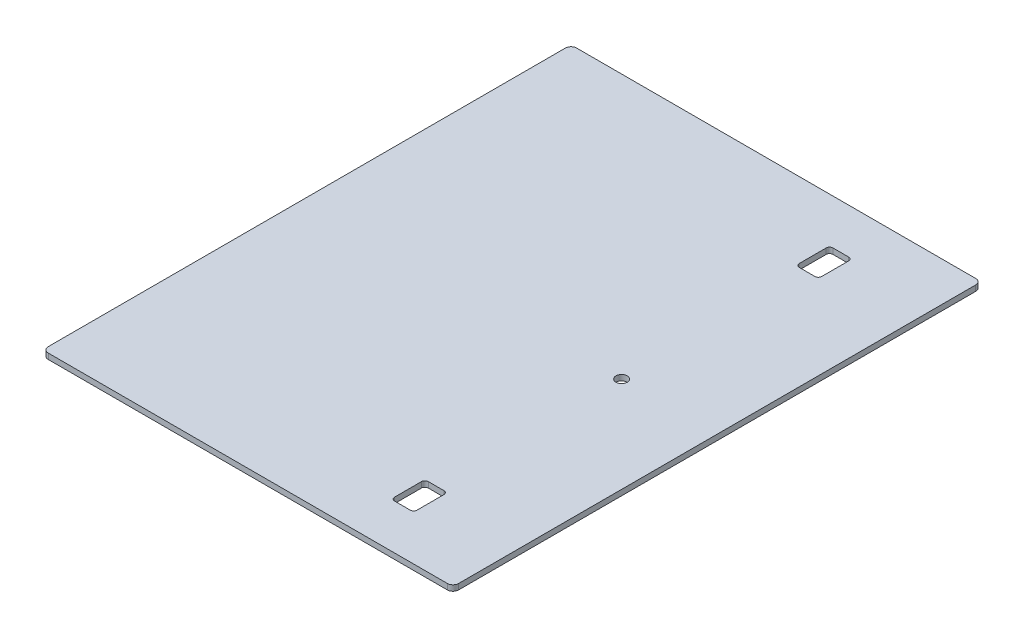
ISO-10303-21;
HEADER;
FILE_DESCRIPTION(('STEP AP214'),'2;1');
FILE_NAME('part.step','',(''),(''),'','','');
FILE_SCHEMA(('AUTOMOTIVE_DESIGN { 1 0 10303 214 1 1 1 1 }'));
ENDSEC;
DATA;
#1=APPLICATION_CONTEXT('core data for automotive mechanical design processes');
#2=APPLICATION_PROTOCOL_DEFINITION('international standard','automotive_design',2000,#1);
#3=PRODUCT_CONTEXT('',#1,'mechanical');
#4=PRODUCT('Part','Part','',(#3));
#5=PRODUCT_RELATED_PRODUCT_CATEGORY('part','',(#4));
#6=PRODUCT_DEFINITION_FORMATION('','',#4);
#7=PRODUCT_DEFINITION_CONTEXT('part definition',#1,'design');
#8=PRODUCT_DEFINITION('design','',#6,#7);
#9=PRODUCT_DEFINITION_SHAPE('','',#8);
#10=(LENGTH_UNIT() NAMED_UNIT(*) SI_UNIT(.MILLI.,.METRE.));
#11=(NAMED_UNIT(*) PLANE_ANGLE_UNIT() SI_UNIT($,.RADIAN.));
#12=(NAMED_UNIT(*) SI_UNIT($,.STERADIAN.) SOLID_ANGLE_UNIT());
#13=UNCERTAINTY_MEASURE_WITH_UNIT(LENGTH_MEASURE(1.E-05),#10,'distance_accuracy_value','');
#14=(GEOMETRIC_REPRESENTATION_CONTEXT(3) GLOBAL_UNCERTAINTY_ASSIGNED_CONTEXT((#13)) GLOBAL_UNIT_ASSIGNED_CONTEXT((#10,
#11,#12)) REPRESENTATION_CONTEXT('',''));
#15=CARTESIAN_POINT('',(0.,0.,0.));
#16=DIRECTION('',(0.,0.,1.));
#17=DIRECTION('',(1.,0.,0.));
#18=AXIS2_PLACEMENT_3D('',#15,#16,#17);
#19=CARTESIAN_POINT('',(115.8875,3.175,149.225));
#20=DIRECTION('',(-1.,0.,0.));
#21=DIRECTION('',(0.,0.,1.));
#22=AXIS2_PLACEMENT_3D('',#19,#20,#21);
#23=PLANE('',#22);
#24=DIRECTION('',(0.,0.,-1.));
#25=VECTOR('',#24,1.);
#26=CARTESIAN_POINT('',(115.8875,3.175,149.225));
#27=LINE('',#26,#25);
#28=CARTESIAN_POINT('',(115.8875,3.175,146.05));
#29=VERTEX_POINT('',#28);
#30=CARTESIAN_POINT('',(115.8875,3.175,-146.05));
#31=VERTEX_POINT('',#30);
#32=EDGE_CURVE('E246',#29,#31,#27,.T.);
#33=ORIENTED_EDGE('',*,*,#32,.F.);
#34=DIRECTION('',(0.,-1.,0.));
#35=VECTOR('',#34,1.);
#36=CARTESIAN_POINT('',(115.8875,3.175,146.05));
#37=LINE('',#36,#35);
#38=CARTESIAN_POINT('',(115.8875,0.,146.05));
#39=VERTEX_POINT('',#38);
#40=EDGE_CURVE('E288',#29,#39,#37,.T.);
#41=ORIENTED_EDGE('',*,*,#40,.T.);
#42=DIRECTION('',(0.,0.,-1.));
#43=VECTOR('',#42,1.);
#44=CARTESIAN_POINT('',(115.8875,0.,149.225));
#45=LINE('',#44,#43);
#46=CARTESIAN_POINT('',(115.8875,0.,-146.05));
#47=VERTEX_POINT('',#46);
#48=EDGE_CURVE('E456',#39,#47,#45,.T.);
#49=ORIENTED_EDGE('',*,*,#48,.T.);
#50=DIRECTION('',(0.,-1.,0.));
#51=VECTOR('',#50,1.);
#52=CARTESIAN_POINT('',(115.8875,3.175,-146.05));
#53=LINE('',#52,#51);
#54=EDGE_CURVE('E285',#47,#31,#53,.F.);
#55=ORIENTED_EDGE('',*,*,#54,.T.);
#56=EDGE_LOOP('',(#33,#41,#49,#55));
#57=FACE_BOUND('',#56,.T.);
#58=ADVANCED_FACE('F54',(#57),#23,.F.);
#59=CARTESIAN_POINT('',(-115.8875,3.175,-149.225));
#60=DIRECTION('',(0.,0.,1.));
#61=DIRECTION('',(1.,0.,0.));
#62=AXIS2_PLACEMENT_3D('',#59,#60,#61);
#63=PLANE('',#62);
#64=DIRECTION('',(-1.,0.,0.));
#65=VECTOR('',#64,1.);
#66=CARTESIAN_POINT('',(-115.8875,0.,-149.225));
#67=LINE('',#66,#65);
#68=CARTESIAN_POINT('',(112.7125,0.,-149.225));
#69=VERTEX_POINT('',#68);
#70=CARTESIAN_POINT('',(-112.7125,0.,-149.225));
#71=VERTEX_POINT('',#70);
#72=EDGE_CURVE('E255',#69,#71,#67,.T.);
#73=ORIENTED_EDGE('',*,*,#72,.T.);
#74=DIRECTION('',(0.,-1.,0.));
#75=VECTOR('',#74,1.);
#76=CARTESIAN_POINT('',(-112.7125,3.175,-149.225));
#77=LINE('',#76,#75);
#78=CARTESIAN_POINT('',(-112.7125,3.175,-149.225));
#79=VERTEX_POINT('',#78);
#80=EDGE_CURVE('E296',#71,#79,#77,.F.);
#81=ORIENTED_EDGE('',*,*,#80,.T.);
#82=DIRECTION('',(-1.,0.,0.));
#83=VECTOR('',#82,1.);
#84=CARTESIAN_POINT('',(-115.8875,3.175,-149.225));
#85=LINE('',#84,#83);
#86=CARTESIAN_POINT('',(112.7125,3.175,-149.225));
#87=VERTEX_POINT('',#86);
#88=EDGE_CURVE('E253',#87,#79,#85,.T.);
#89=ORIENTED_EDGE('',*,*,#88,.F.);
#90=DIRECTION('',(0.,-1.,0.));
#91=VECTOR('',#90,1.);
#92=CARTESIAN_POINT('',(112.7125,3.175,-149.225));
#93=LINE('',#92,#91);
#94=EDGE_CURVE('E292',#87,#69,#93,.T.);
#95=ORIENTED_EDGE('',*,*,#94,.T.);
#96=EDGE_LOOP('',(#73,#81,#89,#95));
#97=FACE_BOUND('',#96,.T.);
#98=ADVANCED_FACE('F475',(#97),#63,.F.);
#99=CARTESIAN_POINT('',(-115.8875,3.175,149.225));
#100=DIRECTION('',(1.,0.,0.));
#101=DIRECTION('',(0.,0.,-1.));
#102=AXIS2_PLACEMENT_3D('',#99,#100,#101);
#103=PLANE('',#102);
#104=DIRECTION('',(0.,0.,1.));
#105=VECTOR('',#104,1.);
#106=CARTESIAN_POINT('',(-115.8875,0.,149.225));
#107=LINE('',#106,#105);
#108=CARTESIAN_POINT('',(-115.8875,0.,-146.05));
#109=VERTEX_POINT('',#108);
#110=CARTESIAN_POINT('',(-115.8875,0.,146.05));
#111=VERTEX_POINT('',#110);
#112=EDGE_CURVE('E247',#109,#111,#107,.T.);
#113=ORIENTED_EDGE('',*,*,#112,.T.);
#114=DIRECTION('',(0.,-1.,0.));
#115=VECTOR('',#114,1.);
#116=CARTESIAN_POINT('',(-115.8875,3.175,146.05));
#117=LINE('',#116,#115);
#118=CARTESIAN_POINT('',(-115.8875,3.175,146.05));
#119=VERTEX_POINT('',#118);
#120=EDGE_CURVE('E222',#111,#119,#117,.F.);
#121=ORIENTED_EDGE('',*,*,#120,.T.);
#122=DIRECTION('',(0.,0.,1.));
#123=VECTOR('',#122,1.);
#124=CARTESIAN_POINT('',(-115.8875,3.175,149.225));
#125=LINE('',#124,#123);
#126=CARTESIAN_POINT('',(-115.8875,3.175,-146.05));
#127=VERTEX_POINT('',#126);
#128=EDGE_CURVE('E461',#127,#119,#125,.T.);
#129=ORIENTED_EDGE('',*,*,#128,.F.);
#130=DIRECTION('',(0.,-1.,0.));
#131=VECTOR('',#130,1.);
#132=CARTESIAN_POINT('',(-115.8875,3.175,-146.05));
#133=LINE('',#132,#131);
#134=EDGE_CURVE('E228',#127,#109,#133,.T.);
#135=ORIENTED_EDGE('',*,*,#134,.T.);
#136=EDGE_LOOP('',(#113,#121,#129,#135));
#137=FACE_BOUND('',#136,.T.);
#138=ADVANCED_FACE('F485',(#137),#103,.F.);
#139=CARTESIAN_POINT('',(-115.8875,3.175,149.225));
#140=DIRECTION('',(0.,0.,-1.));
#141=DIRECTION('',(-1.,0.,0.));
#142=AXIS2_PLACEMENT_3D('',#139,#140,#141);
#143=PLANE('',#142);
#144=DIRECTION('',(1.,0.,0.));
#145=VECTOR('',#144,1.);
#146=CARTESIAN_POINT('',(-115.8875,3.175,149.225));
#147=LINE('',#146,#145);
#148=CARTESIAN_POINT('',(-112.7125,3.175,149.225));
#149=VERTEX_POINT('',#148);
#150=CARTESIAN_POINT('',(112.7125,3.175,149.225));
#151=VERTEX_POINT('',#150);
#152=EDGE_CURVE('E238',#149,#151,#147,.T.);
#153=ORIENTED_EDGE('',*,*,#152,.F.);
#154=DIRECTION('',(0.,-1.,0.));
#155=VECTOR('',#154,1.);
#156=CARTESIAN_POINT('',(-112.7125,3.175,149.225));
#157=LINE('',#156,#155);
#158=CARTESIAN_POINT('',(-112.7125,0.,149.225));
#159=VERTEX_POINT('',#158);
#160=EDGE_CURVE('E221',#149,#159,#157,.T.);
#161=ORIENTED_EDGE('',*,*,#160,.T.);
#162=DIRECTION('',(1.,0.,0.));
#163=VECTOR('',#162,1.);
#164=CARTESIAN_POINT('',(-115.8875,0.,149.225));
#165=LINE('',#164,#163);
#166=CARTESIAN_POINT('',(112.7125,0.,149.225));
#167=VERTEX_POINT('',#166);
#168=EDGE_CURVE('E235',#159,#167,#165,.T.);
#169=ORIENTED_EDGE('',*,*,#168,.T.);
#170=DIRECTION('',(0.,-1.,0.));
#171=VECTOR('',#170,1.);
#172=CARTESIAN_POINT('',(112.7125,3.175,149.225));
#173=LINE('',#172,#171);
#174=EDGE_CURVE('E241',#167,#151,#173,.F.);
#175=ORIENTED_EDGE('',*,*,#174,.T.);
#176=EDGE_LOOP('',(#153,#161,#169,#175));
#177=FACE_BOUND('',#176,.T.);
#178=ADVANCED_FACE('F234',(#177),#143,.F.);
#179=CARTESIAN_POINT('',(0.,3.175,0.));
#180=DIRECTION('',(0.,-1.,0.));
#181=DIRECTION('',(0.,0.,-1.));
#182=AXIS2_PLACEMENT_3D('',#179,#180,#181);
#183=PLANE('',#182);
#184=DIRECTION('',(1.,0.,0.));
#185=VECTOR('',#184,1.);
#186=CARTESIAN_POINT('',(55.5624999999997,3.175,123.825));
#187=LINE('',#186,#185);
#188=CARTESIAN_POINT('',(57.4674999999997,3.175,123.825));
#189=VERTEX_POINT('',#188);
#190=CARTESIAN_POINT('',(66.3574999999997,3.175,123.825));
#191=VERTEX_POINT('',#190);
#192=EDGE_CURVE('E603',#189,#191,#187,.T.);
#193=ORIENTED_EDGE('',*,*,#192,.F.);
#194=CARTESIAN_POINT('',(57.4674999999997,3.175,121.92));
#195=DIRECTION('',(0.,-1.,0.));
#196=DIRECTION('',(0.,0.,-1.));
#197=AXIS2_PLACEMENT_3D('',#194,#195,#196);
#198=CIRCLE('',#197,1.905);
#199=CARTESIAN_POINT('',(55.5624999999997,3.175,121.92));
#200=VERTEX_POINT('',#199);
#201=EDGE_CURVE('E372',#189,#200,#198,.T.);
#202=ORIENTED_EDGE('',*,*,#201,.T.);
#203=DIRECTION('',(0.,0.,1.));
#204=VECTOR('',#203,1.);
#205=CARTESIAN_POINT('',(55.5624999999997,3.175,104.775));
#206=LINE('',#205,#204);
#207=CARTESIAN_POINT('',(55.5624999999997,3.175,106.68));
#208=VERTEX_POINT('',#207);
#209=EDGE_CURVE('E438',#208,#200,#206,.T.);
#210=ORIENTED_EDGE('',*,*,#209,.F.);
#211=CARTESIAN_POINT('',(57.4674999999997,3.175,106.68));
#212=DIRECTION('',(0.,-1.,0.));
#213=DIRECTION('',(0.,0.,-1.));
#214=AXIS2_PLACEMENT_3D('',#211,#212,#213);
#215=CIRCLE('',#214,1.905);
#216=CARTESIAN_POINT('',(57.4674999999997,3.175,104.775));
#217=VERTEX_POINT('',#216);
#218=EDGE_CURVE('E366',#208,#217,#215,.T.);
#219=ORIENTED_EDGE('',*,*,#218,.T.);
#220=DIRECTION('',(-1.,0.,0.));
#221=VECTOR('',#220,1.);
#222=CARTESIAN_POINT('',(55.5624999999997,3.175,104.775));
#223=LINE('',#222,#221);
#224=CARTESIAN_POINT('',(66.3574999999997,3.175,104.775));
#225=VERTEX_POINT('',#224);
#226=EDGE_CURVE('E431',#225,#217,#223,.T.);
#227=ORIENTED_EDGE('',*,*,#226,.F.);
#228=CARTESIAN_POINT('',(66.3574999999997,3.175,106.68));
#229=DIRECTION('',(0.,-1.,0.));
#230=DIRECTION('',(0.,0.,-1.));
#231=AXIS2_PLACEMENT_3D('',#228,#229,#230);
#232=CIRCLE('',#231,1.905);
#233=CARTESIAN_POINT('',(68.2624999999997,3.175,106.68));
#234=VERTEX_POINT('',#233);
#235=EDGE_CURVE('E360',#225,#234,#232,.T.);
#236=ORIENTED_EDGE('',*,*,#235,.T.);
#237=DIRECTION('',(0.,0.,-1.));
#238=VECTOR('',#237,1.);
#239=CARTESIAN_POINT('',(68.2624999999997,3.175,104.775));
#240=LINE('',#239,#238);
#241=CARTESIAN_POINT('',(68.2624999999997,3.175,121.92));
#242=VERTEX_POINT('',#241);
#243=EDGE_CURVE('E608',#242,#234,#240,.T.);
#244=ORIENTED_EDGE('',*,*,#243,.F.);
#245=CARTESIAN_POINT('',(66.3574999999997,3.175,121.92));
#246=DIRECTION('',(0.,-1.,0.));
#247=DIRECTION('',(0.,0.,-1.));
#248=AXIS2_PLACEMENT_3D('',#245,#246,#247);
#249=CIRCLE('',#248,1.905);
#250=EDGE_CURVE('E354',#242,#191,#249,.T.);
#251=ORIENTED_EDGE('',*,*,#250,.T.);
#252=EDGE_LOOP('',(#193,#202,#210,#219,#227,#236,#244,#251));
#253=FACE_BOUND('',#252,.T.);
#254=DIRECTION('',(1.,0.,0.));
#255=VECTOR('',#254,1.);
#256=CARTESIAN_POINT('',(55.5624999999997,3.175,-104.775));
#257=LINE('',#256,#255);
#258=CARTESIAN_POINT('',(57.4674999999997,3.175,-104.775));
#259=VERTEX_POINT('',#258);
#260=CARTESIAN_POINT('',(66.3574999999997,3.175,-104.775));
#261=VERTEX_POINT('',#260);
#262=EDGE_CURVE('E441',#259,#261,#257,.T.);
#263=ORIENTED_EDGE('',*,*,#262,.F.);
#264=CARTESIAN_POINT('',(57.4674999999997,3.175,-106.68));
#265=DIRECTION('',(0.,-1.,0.));
#266=DIRECTION('',(0.,0.,-1.));
#267=AXIS2_PLACEMENT_3D('',#264,#265,#266);
#268=CIRCLE('',#267,1.905);
#269=CARTESIAN_POINT('',(55.5624999999997,3.175,-106.68));
#270=VERTEX_POINT('',#269);
#271=EDGE_CURVE('E378',#259,#270,#268,.T.);
#272=ORIENTED_EDGE('',*,*,#271,.T.);
#273=DIRECTION('',(0.,0.,1.));
#274=VECTOR('',#273,1.);
#275=CARTESIAN_POINT('',(55.5624999999997,3.175,-123.825));
#276=LINE('',#275,#274);
#277=CARTESIAN_POINT('',(55.5624999999997,3.175,-121.92));
#278=VERTEX_POINT('',#277);
#279=EDGE_CURVE('E404',#278,#270,#276,.T.);
#280=ORIENTED_EDGE('',*,*,#279,.F.);
#281=CARTESIAN_POINT('',(57.4674999999997,3.175,-121.92));
#282=DIRECTION('',(0.,-1.,0.));
#283=DIRECTION('',(0.,0.,-1.));
#284=AXIS2_PLACEMENT_3D('',#281,#282,#283);
#285=CIRCLE('',#284,1.905);
#286=CARTESIAN_POINT('',(57.4674999999997,3.175,-123.825));
#287=VERTEX_POINT('',#286);
#288=EDGE_CURVE('E63',#278,#287,#285,.T.);
#289=ORIENTED_EDGE('',*,*,#288,.T.);
#290=DIRECTION('',(-1.,0.,0.));
#291=VECTOR('',#290,1.);
#292=CARTESIAN_POINT('',(55.5624999999997,3.175,-123.825));
#293=LINE('',#292,#291);
#294=CARTESIAN_POINT('',(66.3574999999997,3.175,-123.825));
#295=VERTEX_POINT('',#294);
#296=EDGE_CURVE('E402',#295,#287,#293,.T.);
#297=ORIENTED_EDGE('',*,*,#296,.F.);
#298=CARTESIAN_POINT('',(66.3574999999997,3.175,-121.92));
#299=DIRECTION('',(0.,-1.,0.));
#300=DIRECTION('',(0.,0.,-1.));
#301=AXIS2_PLACEMENT_3D('',#298,#299,#300);
#302=CIRCLE('',#301,1.905);
#303=CARTESIAN_POINT('',(68.2624999999997,3.175,-121.92));
#304=VERTEX_POINT('',#303);
#305=EDGE_CURVE('E390',#295,#304,#302,.T.);
#306=ORIENTED_EDGE('',*,*,#305,.T.);
#307=DIRECTION('',(0.,0.,-1.));
#308=VECTOR('',#307,1.);
#309=CARTESIAN_POINT('',(68.2624999999997,3.175,-123.825));
#310=LINE('',#309,#308);
#311=CARTESIAN_POINT('',(68.2624999999997,3.175,-106.68));
#312=VERTEX_POINT('',#311);
#313=EDGE_CURVE('E411',#312,#304,#310,.T.);
#314=ORIENTED_EDGE('',*,*,#313,.F.);
#315=CARTESIAN_POINT('',(66.3574999999997,3.175,-106.68));
#316=DIRECTION('',(0.,-1.,0.));
#317=DIRECTION('',(0.,0.,-1.));
#318=AXIS2_PLACEMENT_3D('',#315,#316,#317);
#319=CIRCLE('',#318,1.905);
#320=EDGE_CURVE('E384',#312,#261,#319,.T.);
#321=ORIENTED_EDGE('',*,*,#320,.T.);
#322=EDGE_LOOP('',(#263,#272,#280,#289,#297,#306,#314,#321));
#323=FACE_BOUND('',#322,.T.);
#324=CARTESIAN_POINT('',(61.9124999999997,3.175,0.));
#325=DIRECTION('',(0.,1.,0.));
#326=DIRECTION('',(0.,0.,1.));
#327=AXIS2_PLACEMENT_3D('',#324,#325,#326);
#328=CIRCLE('',#327,3.17499999999998);
#329=CARTESIAN_POINT('',(61.9124999999997,3.175,3.17499999999998));
#330=VERTEX_POINT('',#329);
#331=EDGE_CURVE('E448',#330,#330,#328,.T.);
#332=ORIENTED_EDGE('',*,*,#331,.F.);
#333=EDGE_LOOP('',(#332));
#334=FACE_BOUND('',#333,.T.);
#335=ORIENTED_EDGE('',*,*,#128,.T.);
#336=CARTESIAN_POINT('',(-112.7125,3.175,146.05));
#337=DIRECTION('',(0.,-1.,0.));
#338=DIRECTION('',(0.,0.,-1.));
#339=AXIS2_PLACEMENT_3D('',#336,#337,#338);
#340=CIRCLE('',#339,3.175);
#341=EDGE_CURVE('E282',#119,#149,#340,.F.);
#342=ORIENTED_EDGE('',*,*,#341,.T.);
#343=ORIENTED_EDGE('',*,*,#152,.T.);
#344=CARTESIAN_POINT('',(112.7125,3.175,146.05));
#345=DIRECTION('',(0.,-1.,0.));
#346=DIRECTION('',(0.,0.,-1.));
#347=AXIS2_PLACEMENT_3D('',#344,#345,#346);
#348=CIRCLE('',#347,3.175);
#349=EDGE_CURVE('E279',#151,#29,#348,.F.);
#350=ORIENTED_EDGE('',*,*,#349,.T.);
#351=ORIENTED_EDGE('',*,*,#32,.T.);
#352=CARTESIAN_POINT('',(112.7125,3.175,-146.05));
#353=DIRECTION('',(0.,-1.,0.));
#354=DIRECTION('',(0.,0.,-1.));
#355=AXIS2_PLACEMENT_3D('',#352,#353,#354);
#356=CIRCLE('',#355,3.175);
#357=EDGE_CURVE('E273',#31,#87,#356,.F.);
#358=ORIENTED_EDGE('',*,*,#357,.T.);
#359=ORIENTED_EDGE('',*,*,#88,.T.);
#360=CARTESIAN_POINT('',(-112.7125,3.175,-146.05));
#361=DIRECTION('',(0.,-1.,0.));
#362=DIRECTION('',(0.,0.,-1.));
#363=AXIS2_PLACEMENT_3D('',#360,#361,#362);
#364=CIRCLE('',#363,3.175);
#365=EDGE_CURVE('E276',#79,#127,#364,.F.);
#366=ORIENTED_EDGE('',*,*,#365,.T.);
#367=EDGE_LOOP('',(#335,#342,#343,#350,#351,#358,#359,#366));
#368=FACE_BOUND('',#367,.T.);
#369=ADVANCED_FACE('F400',(#253,#323,#334,#368),#183,.F.);
#370=CARTESIAN_POINT('',(0.,0.,0.));
#371=DIRECTION('',(0.,-1.,0.));
#372=DIRECTION('',(0.,0.,-1.));
#373=AXIS2_PLACEMENT_3D('',#370,#371,#372);
#374=PLANE('',#373);
#375=DIRECTION('',(-1.,0.,0.));
#376=VECTOR('',#375,1.);
#377=CARTESIAN_POINT('',(55.5624999999997,0.,104.775));
#378=LINE('',#377,#376);
#379=CARTESIAN_POINT('',(66.3574999999997,0.,104.775));
#380=VERTEX_POINT('',#379);
#381=CARTESIAN_POINT('',(57.4674999999997,0.,104.775));
#382=VERTEX_POINT('',#381);
#383=EDGE_CURVE('E453',#380,#382,#378,.T.);
#384=ORIENTED_EDGE('',*,*,#383,.T.);
#385=CARTESIAN_POINT('',(57.4674999999997,0.,106.68));
#386=DIRECTION('',(0.,-1.,0.));
#387=DIRECTION('',(0.,0.,-1.));
#388=AXIS2_PLACEMENT_3D('',#385,#386,#387);
#389=CIRCLE('',#388,1.905);
#390=CARTESIAN_POINT('',(55.5624999999997,0.,106.68));
#391=VERTEX_POINT('',#390);
#392=EDGE_CURVE('E369',#382,#391,#389,.F.);
#393=ORIENTED_EDGE('',*,*,#392,.T.);
#394=DIRECTION('',(0.,0.,1.));
#395=VECTOR('',#394,1.);
#396=CARTESIAN_POINT('',(55.5624999999997,0.,104.775));
#397=LINE('',#396,#395);
#398=CARTESIAN_POINT('',(55.5624999999997,0.,121.92));
#399=VERTEX_POINT('',#398);
#400=EDGE_CURVE('E598',#391,#399,#397,.T.);
#401=ORIENTED_EDGE('',*,*,#400,.T.);
#402=CARTESIAN_POINT('',(57.4674999999997,0.,121.92));
#403=DIRECTION('',(0.,-1.,0.));
#404=DIRECTION('',(0.,0.,-1.));
#405=AXIS2_PLACEMENT_3D('',#402,#403,#404);
#406=CIRCLE('',#405,1.905);
#407=CARTESIAN_POINT('',(57.4674999999997,0.,123.825));
#408=VERTEX_POINT('',#407);
#409=EDGE_CURVE('E375',#399,#408,#406,.F.);
#410=ORIENTED_EDGE('',*,*,#409,.T.);
#411=DIRECTION('',(1.,0.,0.));
#412=VECTOR('',#411,1.);
#413=CARTESIAN_POINT('',(55.5624999999997,0.,123.825));
#414=LINE('',#413,#412);
#415=CARTESIAN_POINT('',(66.3574999999997,0.,123.825));
#416=VERTEX_POINT('',#415);
#417=EDGE_CURVE('E620',#408,#416,#414,.T.);
#418=ORIENTED_EDGE('',*,*,#417,.T.);
#419=CARTESIAN_POINT('',(66.3574999999997,0.,121.92));
#420=DIRECTION('',(0.,-1.,0.));
#421=DIRECTION('',(0.,0.,-1.));
#422=AXIS2_PLACEMENT_3D('',#419,#420,#421);
#423=CIRCLE('',#422,1.905);
#424=CARTESIAN_POINT('',(68.2624999999997,0.,121.92));
#425=VERTEX_POINT('',#424);
#426=EDGE_CURVE('E357',#416,#425,#423,.F.);
#427=ORIENTED_EDGE('',*,*,#426,.T.);
#428=DIRECTION('',(0.,0.,-1.));
#429=VECTOR('',#428,1.);
#430=CARTESIAN_POINT('',(68.2624999999997,0.,104.775));
#431=LINE('',#430,#429);
#432=CARTESIAN_POINT('',(68.2624999999997,0.,106.68));
#433=VERTEX_POINT('',#432);
#434=EDGE_CURVE('E591',#425,#433,#431,.T.);
#435=ORIENTED_EDGE('',*,*,#434,.T.);
#436=CARTESIAN_POINT('',(66.3574999999997,0.,106.68));
#437=DIRECTION('',(0.,-1.,0.));
#438=DIRECTION('',(0.,0.,-1.));
#439=AXIS2_PLACEMENT_3D('',#436,#437,#438);
#440=CIRCLE('',#439,1.905);
#441=EDGE_CURVE('E363',#433,#380,#440,.F.);
#442=ORIENTED_EDGE('',*,*,#441,.T.);
#443=EDGE_LOOP('',(#384,#393,#401,#410,#418,#427,#435,#442));
#444=FACE_BOUND('',#443,.T.);
#445=DIRECTION('',(-1.,0.,0.));
#446=VECTOR('',#445,1.);
#447=CARTESIAN_POINT('',(55.5624999999997,0.,-123.825));
#448=LINE('',#447,#446);
#449=CARTESIAN_POINT('',(66.3574999999997,0.,-123.825));
#450=VERTEX_POINT('',#449);
#451=CARTESIAN_POINT('',(57.4674999999997,0.,-123.825));
#452=VERTEX_POINT('',#451);
#453=EDGE_CURVE('E418',#450,#452,#448,.T.);
#454=ORIENTED_EDGE('',*,*,#453,.T.);
#455=CARTESIAN_POINT('',(57.4674999999997,0.,-121.92));
#456=DIRECTION('',(0.,-1.,0.));
#457=DIRECTION('',(0.,0.,-1.));
#458=AXIS2_PLACEMENT_3D('',#455,#456,#457);
#459=CIRCLE('',#458,1.905);
#460=CARTESIAN_POINT('',(55.5624999999997,0.,-121.92));
#461=VERTEX_POINT('',#460);
#462=EDGE_CURVE('E12',#452,#461,#459,.F.);
#463=ORIENTED_EDGE('',*,*,#462,.T.);
#464=DIRECTION('',(0.,0.,1.));
#465=VECTOR('',#464,1.);
#466=CARTESIAN_POINT('',(55.5624999999997,0.,-123.825));
#467=LINE('',#466,#465);
#468=CARTESIAN_POINT('',(55.5624999999997,0.,-106.68));
#469=VERTEX_POINT('',#468);
#470=EDGE_CURVE('E410',#461,#469,#467,.T.);
#471=ORIENTED_EDGE('',*,*,#470,.T.);
#472=CARTESIAN_POINT('',(57.4674999999997,0.,-106.68));
#473=DIRECTION('',(0.,-1.,0.));
#474=DIRECTION('',(0.,0.,-1.));
#475=AXIS2_PLACEMENT_3D('',#472,#473,#474);
#476=CIRCLE('',#475,1.905);
#477=CARTESIAN_POINT('',(57.4674999999997,0.,-104.775));
#478=VERTEX_POINT('',#477);
#479=EDGE_CURVE('E381',#469,#478,#476,.F.);
#480=ORIENTED_EDGE('',*,*,#479,.T.);
#481=DIRECTION('',(1.,0.,0.));
#482=VECTOR('',#481,1.);
#483=CARTESIAN_POINT('',(55.5624999999997,0.,-104.775));
#484=LINE('',#483,#482);
#485=CARTESIAN_POINT('',(66.3574999999997,0.,-104.775));
#486=VERTEX_POINT('',#485);
#487=EDGE_CURVE('E423',#478,#486,#484,.T.);
#488=ORIENTED_EDGE('',*,*,#487,.T.);
#489=CARTESIAN_POINT('',(66.3574999999997,0.,-106.68));
#490=DIRECTION('',(0.,-1.,0.));
#491=DIRECTION('',(0.,0.,-1.));
#492=AXIS2_PLACEMENT_3D('',#489,#490,#491);
#493=CIRCLE('',#492,1.905);
#494=CARTESIAN_POINT('',(68.2624999999997,0.,-106.68));
#495=VERTEX_POINT('',#494);
#496=EDGE_CURVE('E387',#486,#495,#493,.F.);
#497=ORIENTED_EDGE('',*,*,#496,.T.);
#498=DIRECTION('',(0.,0.,-1.));
#499=VECTOR('',#498,1.);
#500=CARTESIAN_POINT('',(68.2624999999997,0.,-123.825));
#501=LINE('',#500,#499);
#502=CARTESIAN_POINT('',(68.2624999999997,0.,-121.92));
#503=VERTEX_POINT('',#502);
#504=EDGE_CURVE('E428',#495,#503,#501,.T.);
#505=ORIENTED_EDGE('',*,*,#504,.T.);
#506=CARTESIAN_POINT('',(66.3574999999997,0.,-121.92));
#507=DIRECTION('',(0.,-1.,0.));
#508=DIRECTION('',(0.,0.,-1.));
#509=AXIS2_PLACEMENT_3D('',#506,#507,#508);
#510=CIRCLE('',#509,1.905);
#511=EDGE_CURVE('E77',#503,#450,#510,.F.);
#512=ORIENTED_EDGE('',*,*,#511,.T.);
#513=EDGE_LOOP('',(#454,#463,#471,#480,#488,#497,#505,#512));
#514=FACE_BOUND('',#513,.T.);
#515=CARTESIAN_POINT('',(61.9124999999997,0.,0.));
#516=DIRECTION('',(0.,1.,0.));
#517=DIRECTION('',(0.,0.,1.));
#518=AXIS2_PLACEMENT_3D('',#515,#516,#517);
#519=CIRCLE('',#518,3.175);
#520=CARTESIAN_POINT('',(61.9124999999997,0.,3.175));
#521=VERTEX_POINT('',#520);
#522=EDGE_CURVE('E452',#521,#521,#519,.T.);
#523=ORIENTED_EDGE('',*,*,#522,.T.);
#524=EDGE_LOOP('',(#523));
#525=FACE_BOUND('',#524,.T.);
#526=ORIENTED_EDGE('',*,*,#168,.F.);
#527=CARTESIAN_POINT('',(-112.7125,0.,146.05));
#528=DIRECTION('',(0.,-1.,0.));
#529=DIRECTION('',(0.,0.,-1.));
#530=AXIS2_PLACEMENT_3D('',#527,#528,#529);
#531=CIRCLE('',#530,3.175);
#532=EDGE_CURVE('E217',#159,#111,#531,.T.);
#533=ORIENTED_EDGE('',*,*,#532,.T.);
#534=ORIENTED_EDGE('',*,*,#112,.F.);
#535=CARTESIAN_POINT('',(-112.7125,0.,-146.05));
#536=DIRECTION('',(0.,-1.,0.));
#537=DIRECTION('',(0.,0.,-1.));
#538=AXIS2_PLACEMENT_3D('',#535,#536,#537);
#539=CIRCLE('',#538,3.175);
#540=EDGE_CURVE('E263',#109,#71,#539,.T.);
#541=ORIENTED_EDGE('',*,*,#540,.T.);
#542=ORIENTED_EDGE('',*,*,#72,.F.);
#543=CARTESIAN_POINT('',(112.7125,0.,-146.05));
#544=DIRECTION('',(0.,-1.,0.));
#545=DIRECTION('',(0.,0.,-1.));
#546=AXIS2_PLACEMENT_3D('',#543,#544,#545);
#547=CIRCLE('',#546,3.175);
#548=EDGE_CURVE('E240',#69,#47,#547,.T.);
#549=ORIENTED_EDGE('',*,*,#548,.T.);
#550=ORIENTED_EDGE('',*,*,#48,.F.);
#551=CARTESIAN_POINT('',(112.7125,0.,146.05));
#552=DIRECTION('',(0.,-1.,0.));
#553=DIRECTION('',(0.,0.,-1.));
#554=AXIS2_PLACEMENT_3D('',#551,#552,#553);
#555=CIRCLE('',#554,3.175);
#556=EDGE_CURVE('E229',#39,#167,#555,.T.);
#557=ORIENTED_EDGE('',*,*,#556,.T.);
#558=EDGE_LOOP('',(#526,#533,#534,#541,#542,#549,#550,#557));
#559=FACE_BOUND('',#558,.T.);
#560=ADVANCED_FACE('F243',(#444,#514,#525,#559),#374,.T.);
#561=CARTESIAN_POINT('',(61.9124999999997,3.175,0.));
#562=DIRECTION('',(0.,1.,0.));
#563=DIRECTION('',(0.,0.,1.));
#564=AXIS2_PLACEMENT_3D('',#561,#562,#563);
#565=CYLINDRICAL_SURFACE('',#564,3.17499999999999);
#566=ORIENTED_EDGE('',*,*,#522,.F.);
#567=EDGE_LOOP('',(#566));
#568=FACE_BOUND('',#567,.T.);
#569=ORIENTED_EDGE('',*,*,#331,.T.);
#570=EDGE_LOOP('',(#569));
#571=FACE_BOUND('',#570,.T.);
#572=ADVANCED_FACE('F504',(#568,#571),#565,.F.);
#573=CARTESIAN_POINT('',(-112.7125,3.175,146.05));
#574=DIRECTION('',(0.,-1.,0.));
#575=DIRECTION('',(0.,0.,-1.));
#576=AXIS2_PLACEMENT_3D('',#573,#574,#575);
#577=CYLINDRICAL_SURFACE('',#576,3.175);
#578=ORIENTED_EDGE('',*,*,#341,.F.);
#579=ORIENTED_EDGE('',*,*,#120,.F.);
#580=ORIENTED_EDGE('',*,*,#532,.F.);
#581=ORIENTED_EDGE('',*,*,#160,.F.);
#582=EDGE_LOOP('',(#578,#579,#580,#581));
#583=FACE_BOUND('',#582,.T.);
#584=ADVANCED_FACE('F220',(#583),#577,.T.);
#585=CARTESIAN_POINT('',(112.7125,3.175,146.05));
#586=DIRECTION('',(0.,-1.,0.));
#587=DIRECTION('',(0.,0.,-1.));
#588=AXIS2_PLACEMENT_3D('',#585,#586,#587);
#589=CYLINDRICAL_SURFACE('',#588,3.175);
#590=ORIENTED_EDGE('',*,*,#349,.F.);
#591=ORIENTED_EDGE('',*,*,#174,.F.);
#592=ORIENTED_EDGE('',*,*,#556,.F.);
#593=ORIENTED_EDGE('',*,*,#40,.F.);
#594=EDGE_LOOP('',(#590,#591,#592,#593));
#595=FACE_BOUND('',#594,.T.);
#596=ADVANCED_FACE('F503',(#595),#589,.T.);
#597=CARTESIAN_POINT('',(-112.7125,3.175,-146.05));
#598=DIRECTION('',(0.,-1.,0.));
#599=DIRECTION('',(0.,0.,-1.));
#600=AXIS2_PLACEMENT_3D('',#597,#598,#599);
#601=CYLINDRICAL_SURFACE('',#600,3.175);
#602=ORIENTED_EDGE('',*,*,#365,.F.);
#603=ORIENTED_EDGE('',*,*,#80,.F.);
#604=ORIENTED_EDGE('',*,*,#540,.F.);
#605=ORIENTED_EDGE('',*,*,#134,.F.);
#606=EDGE_LOOP('',(#602,#603,#604,#605));
#607=FACE_BOUND('',#606,.T.);
#608=ADVANCED_FACE('F480',(#607),#601,.T.);
#609=CARTESIAN_POINT('',(112.7125,3.175,-146.05));
#610=DIRECTION('',(0.,-1.,0.));
#611=DIRECTION('',(0.,0.,-1.));
#612=AXIS2_PLACEMENT_3D('',#609,#610,#611);
#613=CYLINDRICAL_SURFACE('',#612,3.175);
#614=ORIENTED_EDGE('',*,*,#357,.F.);
#615=ORIENTED_EDGE('',*,*,#54,.F.);
#616=ORIENTED_EDGE('',*,*,#548,.F.);
#617=ORIENTED_EDGE('',*,*,#94,.F.);
#618=EDGE_LOOP('',(#614,#615,#616,#617));
#619=FACE_BOUND('',#618,.T.);
#620=ADVANCED_FACE('F510',(#619),#613,.T.);
#621=CARTESIAN_POINT('',(55.5624999999997,0.,-123.825));
#622=DIRECTION('',(-1.,0.,0.));
#623=DIRECTION('',(0.,0.,1.));
#624=AXIS2_PLACEMENT_3D('',#621,#622,#623);
#625=PLANE('',#624);
#626=ORIENTED_EDGE('',*,*,#279,.T.);
#627=DIRECTION('',(0.,1.,0.));
#628=VECTOR('',#627,1.);
#629=CARTESIAN_POINT('',(55.5624999999997,0.,-106.68));
#630=LINE('',#629,#628);
#631=EDGE_CURVE('E338',#270,#469,#630,.F.);
#632=ORIENTED_EDGE('',*,*,#631,.T.);
#633=ORIENTED_EDGE('',*,*,#470,.F.);
#634=DIRECTION('',(0.,1.,0.));
#635=VECTOR('',#634,1.);
#636=CARTESIAN_POINT('',(55.5624999999997,3.175,-121.92));
#637=LINE('',#636,#635);
#638=EDGE_CURVE('E334',#461,#278,#637,.T.);
#639=ORIENTED_EDGE('',*,*,#638,.T.);
#640=EDGE_LOOP('',(#626,#632,#633,#639));
#641=FACE_BOUND('',#640,.T.);
#642=ADVANCED_FACE('F420',(#641),#625,.F.);
#643=CARTESIAN_POINT('',(55.5624999999997,0.,-123.825));
#644=DIRECTION('',(0.,0.,-1.));
#645=DIRECTION('',(-1.,0.,0.));
#646=AXIS2_PLACEMENT_3D('',#643,#644,#645);
#647=PLANE('',#646);
#648=ORIENTED_EDGE('',*,*,#453,.F.);
#649=DIRECTION('',(0.,1.,0.));
#650=VECTOR('',#649,1.);
#651=CARTESIAN_POINT('',(66.3574999999997,3.175,-123.825));
#652=LINE('',#651,#650);
#653=EDGE_CURVE('E350',#450,#295,#652,.T.);
#654=ORIENTED_EDGE('',*,*,#653,.T.);
#655=ORIENTED_EDGE('',*,*,#296,.T.);
#656=DIRECTION('',(0.,1.,0.));
#657=VECTOR('',#656,1.);
#658=CARTESIAN_POINT('',(57.4674999999997,0.,-123.825));
#659=LINE('',#658,#657);
#660=EDGE_CURVE('E70',#287,#452,#659,.F.);
#661=ORIENTED_EDGE('',*,*,#660,.T.);
#662=EDGE_LOOP('',(#648,#654,#655,#661));
#663=FACE_BOUND('',#662,.T.);
#664=ADVANCED_FACE('F407',(#663),#647,.F.);
#665=CARTESIAN_POINT('',(68.2624999999997,0.,-123.825));
#666=DIRECTION('',(1.,0.,0.));
#667=DIRECTION('',(0.,0.,-1.));
#668=AXIS2_PLACEMENT_3D('',#665,#666,#667);
#669=PLANE('',#668);
#670=ORIENTED_EDGE('',*,*,#504,.F.);
#671=DIRECTION('',(0.,1.,0.));
#672=VECTOR('',#671,1.);
#673=CARTESIAN_POINT('',(68.2624999999997,3.175,-106.68));
#674=LINE('',#673,#672);
#675=EDGE_CURVE('E344',#495,#312,#674,.T.);
#676=ORIENTED_EDGE('',*,*,#675,.T.);
#677=ORIENTED_EDGE('',*,*,#313,.T.);
#678=DIRECTION('',(0.,1.,0.));
#679=VECTOR('',#678,1.);
#680=CARTESIAN_POINT('',(68.2624999999997,0.,-121.92));
#681=LINE('',#680,#679);
#682=EDGE_CURVE('E341',#304,#503,#681,.F.);
#683=ORIENTED_EDGE('',*,*,#682,.T.);
#684=EDGE_LOOP('',(#670,#676,#677,#683));
#685=FACE_BOUND('',#684,.T.);
#686=ADVANCED_FACE('F548',(#685),#669,.F.);
#687=CARTESIAN_POINT('',(55.5624999999997,0.,-104.775));
#688=DIRECTION('',(0.,0.,1.));
#689=DIRECTION('',(1.,0.,0.));
#690=AXIS2_PLACEMENT_3D('',#687,#688,#689);
#691=PLANE('',#690);
#692=ORIENTED_EDGE('',*,*,#487,.F.);
#693=DIRECTION('',(0.,1.,0.));
#694=VECTOR('',#693,1.);
#695=CARTESIAN_POINT('',(57.4674999999997,3.175,-104.775));
#696=LINE('',#695,#694);
#697=EDGE_CURVE('E330',#478,#259,#696,.T.);
#698=ORIENTED_EDGE('',*,*,#697,.T.);
#699=ORIENTED_EDGE('',*,*,#262,.T.);
#700=DIRECTION('',(0.,1.,0.));
#701=VECTOR('',#700,1.);
#702=CARTESIAN_POINT('',(66.3574999999997,0.,-104.775));
#703=LINE('',#702,#701);
#704=EDGE_CURVE('E327',#261,#486,#703,.F.);
#705=ORIENTED_EDGE('',*,*,#704,.T.);
#706=EDGE_LOOP('',(#692,#698,#699,#705));
#707=FACE_BOUND('',#706,.T.);
#708=ADVANCED_FACE('F554',(#707),#691,.F.);
#709=CARTESIAN_POINT('',(55.5624999999997,0.,104.775));
#710=DIRECTION('',(-1.,0.,0.));
#711=DIRECTION('',(0.,0.,1.));
#712=AXIS2_PLACEMENT_3D('',#709,#710,#711);
#713=PLANE('',#712);
#714=ORIENTED_EDGE('',*,*,#400,.F.);
#715=DIRECTION('',(0.,1.,0.));
#716=VECTOR('',#715,1.);
#717=CARTESIAN_POINT('',(55.5624999999997,3.175,106.68));
#718=LINE('',#717,#716);
#719=EDGE_CURVE('E323',#391,#208,#718,.T.);
#720=ORIENTED_EDGE('',*,*,#719,.T.);
#721=ORIENTED_EDGE('',*,*,#209,.T.);
#722=DIRECTION('',(0.,1.,0.));
#723=VECTOR('',#722,1.);
#724=CARTESIAN_POINT('',(55.5624999999997,0.,121.92));
#725=LINE('',#724,#723);
#726=EDGE_CURVE('E320',#200,#399,#725,.F.);
#727=ORIENTED_EDGE('',*,*,#726,.T.);
#728=EDGE_LOOP('',(#714,#720,#721,#727));
#729=FACE_BOUND('',#728,.T.);
#730=ADVANCED_FACE('F557',(#729),#713,.F.);
#731=CARTESIAN_POINT('',(55.5624999999997,0.,104.775));
#732=DIRECTION('',(0.,0.,-1.));
#733=DIRECTION('',(-1.,0.,0.));
#734=AXIS2_PLACEMENT_3D('',#731,#732,#733);
#735=PLANE('',#734);
#736=ORIENTED_EDGE('',*,*,#383,.F.);
#737=DIRECTION('',(0.,1.,0.));
#738=VECTOR('',#737,1.);
#739=CARTESIAN_POINT('',(66.3574999999997,3.175,104.775));
#740=LINE('',#739,#738);
#741=EDGE_CURVE('E316',#380,#225,#740,.T.);
#742=ORIENTED_EDGE('',*,*,#741,.T.);
#743=ORIENTED_EDGE('',*,*,#226,.T.);
#744=DIRECTION('',(0.,1.,0.));
#745=VECTOR('',#744,1.);
#746=CARTESIAN_POINT('',(57.4674999999997,0.,104.775));
#747=LINE('',#746,#745);
#748=EDGE_CURVE('E313',#217,#382,#747,.F.);
#749=ORIENTED_EDGE('',*,*,#748,.T.);
#750=EDGE_LOOP('',(#736,#742,#743,#749));
#751=FACE_BOUND('',#750,.T.);
#752=ADVANCED_FACE('F563',(#751),#735,.F.);
#753=CARTESIAN_POINT('',(68.2624999999997,0.,104.775));
#754=DIRECTION('',(1.,0.,0.));
#755=DIRECTION('',(0.,0.,-1.));
#756=AXIS2_PLACEMENT_3D('',#753,#754,#755);
#757=PLANE('',#756);
#758=ORIENTED_EDGE('',*,*,#434,.F.);
#759=DIRECTION('',(0.,1.,0.));
#760=VECTOR('',#759,1.);
#761=CARTESIAN_POINT('',(68.2624999999997,3.175,121.92));
#762=LINE('',#761,#760);
#763=EDGE_CURVE('E302',#425,#242,#762,.T.);
#764=ORIENTED_EDGE('',*,*,#763,.T.);
#765=ORIENTED_EDGE('',*,*,#243,.T.);
#766=DIRECTION('',(0.,1.,0.));
#767=VECTOR('',#766,1.);
#768=CARTESIAN_POINT('',(68.2624999999997,0.,106.68));
#769=LINE('',#768,#767);
#770=EDGE_CURVE('E299',#234,#433,#769,.F.);
#771=ORIENTED_EDGE('',*,*,#770,.T.);
#772=EDGE_LOOP('',(#758,#764,#765,#771));
#773=FACE_BOUND('',#772,.T.);
#774=ADVANCED_FACE('F636',(#773),#757,.F.);
#775=CARTESIAN_POINT('',(55.5624999999997,0.,123.825));
#776=DIRECTION('',(0.,0.,1.));
#777=DIRECTION('',(1.,0.,0.));
#778=AXIS2_PLACEMENT_3D('',#775,#776,#777);
#779=PLANE('',#778);
#780=ORIENTED_EDGE('',*,*,#192,.T.);
#781=DIRECTION('',(0.,1.,0.));
#782=VECTOR('',#781,1.);
#783=CARTESIAN_POINT('',(66.3574999999997,0.,123.825));
#784=LINE('',#783,#782);
#785=EDGE_CURVE('E310',#191,#416,#784,.F.);
#786=ORIENTED_EDGE('',*,*,#785,.T.);
#787=ORIENTED_EDGE('',*,*,#417,.F.);
#788=DIRECTION('',(0.,1.,0.));
#789=VECTOR('',#788,1.);
#790=CARTESIAN_POINT('',(57.4674999999997,3.175,123.825));
#791=LINE('',#790,#789);
#792=EDGE_CURVE('E306',#408,#189,#791,.T.);
#793=ORIENTED_EDGE('',*,*,#792,.T.);
#794=EDGE_LOOP('',(#780,#786,#787,#793));
#795=FACE_BOUND('',#794,.T.);
#796=ADVANCED_FACE('F518',(#795),#779,.F.);
#797=CARTESIAN_POINT('',(66.3574999999997,0.,121.92));
#798=DIRECTION('',(0.,-1.,0.));
#799=DIRECTION('',(0.,0.,-1.));
#800=AXIS2_PLACEMENT_3D('',#797,#798,#799);
#801=CYLINDRICAL_SURFACE('',#800,1.905);
#802=ORIENTED_EDGE('',*,*,#426,.F.);
#803=ORIENTED_EDGE('',*,*,#785,.F.);
#804=ORIENTED_EDGE('',*,*,#250,.F.);
#805=ORIENTED_EDGE('',*,*,#763,.F.);
#806=EDGE_LOOP('',(#802,#803,#804,#805));
#807=FACE_BOUND('',#806,.T.);
#808=ADVANCED_FACE('F514',(#807),#801,.F.);
#809=CARTESIAN_POINT('',(66.3574999999997,0.,106.68));
#810=DIRECTION('',(0.,-1.,0.));
#811=DIRECTION('',(0.,0.,-1.));
#812=AXIS2_PLACEMENT_3D('',#809,#810,#811);
#813=CYLINDRICAL_SURFACE('',#812,1.905);
#814=ORIENTED_EDGE('',*,*,#441,.F.);
#815=ORIENTED_EDGE('',*,*,#770,.F.);
#816=ORIENTED_EDGE('',*,*,#235,.F.);
#817=ORIENTED_EDGE('',*,*,#741,.F.);
#818=EDGE_LOOP('',(#814,#815,#816,#817));
#819=FACE_BOUND('',#818,.T.);
#820=ADVANCED_FACE('F517',(#819),#813,.F.);
#821=CARTESIAN_POINT('',(57.4674999999997,0.,106.68));
#822=DIRECTION('',(0.,-1.,0.));
#823=DIRECTION('',(0.,0.,-1.));
#824=AXIS2_PLACEMENT_3D('',#821,#822,#823);
#825=CYLINDRICAL_SURFACE('',#824,1.905);
#826=ORIENTED_EDGE('',*,*,#392,.F.);
#827=ORIENTED_EDGE('',*,*,#748,.F.);
#828=ORIENTED_EDGE('',*,*,#218,.F.);
#829=ORIENTED_EDGE('',*,*,#719,.F.);
#830=EDGE_LOOP('',(#826,#827,#828,#829));
#831=FACE_BOUND('',#830,.T.);
#832=ADVANCED_FACE('F522',(#831),#825,.F.);
#833=CARTESIAN_POINT('',(57.4674999999997,0.,121.92));
#834=DIRECTION('',(0.,-1.,0.));
#835=DIRECTION('',(0.,0.,-1.));
#836=AXIS2_PLACEMENT_3D('',#833,#834,#835);
#837=CYLINDRICAL_SURFACE('',#836,1.905);
#838=ORIENTED_EDGE('',*,*,#409,.F.);
#839=ORIENTED_EDGE('',*,*,#726,.F.);
#840=ORIENTED_EDGE('',*,*,#201,.F.);
#841=ORIENTED_EDGE('',*,*,#792,.F.);
#842=EDGE_LOOP('',(#838,#839,#840,#841));
#843=FACE_BOUND('',#842,.T.);
#844=ADVANCED_FACE('F526',(#843),#837,.F.);
#845=CARTESIAN_POINT('',(57.4674999999997,0.,-106.68));
#846=DIRECTION('',(0.,-1.,0.));
#847=DIRECTION('',(0.,0.,-1.));
#848=AXIS2_PLACEMENT_3D('',#845,#846,#847);
#849=CYLINDRICAL_SURFACE('',#848,1.905);
#850=ORIENTED_EDGE('',*,*,#479,.F.);
#851=ORIENTED_EDGE('',*,*,#631,.F.);
#852=ORIENTED_EDGE('',*,*,#271,.F.);
#853=ORIENTED_EDGE('',*,*,#697,.F.);
#854=EDGE_LOOP('',(#850,#851,#852,#853));
#855=FACE_BOUND('',#854,.T.);
#856=ADVANCED_FACE('F530',(#855),#849,.F.);
#857=CARTESIAN_POINT('',(66.3574999999997,0.,-106.68));
#858=DIRECTION('',(0.,-1.,0.));
#859=DIRECTION('',(0.,0.,-1.));
#860=AXIS2_PLACEMENT_3D('',#857,#858,#859);
#861=CYLINDRICAL_SURFACE('',#860,1.905);
#862=ORIENTED_EDGE('',*,*,#496,.F.);
#863=ORIENTED_EDGE('',*,*,#704,.F.);
#864=ORIENTED_EDGE('',*,*,#320,.F.);
#865=ORIENTED_EDGE('',*,*,#675,.F.);
#866=EDGE_LOOP('',(#862,#863,#864,#865));
#867=FACE_BOUND('',#866,.T.);
#868=ADVANCED_FACE('F534',(#867),#861,.F.);
#869=CARTESIAN_POINT('',(66.3574999999997,0.,-121.92));
#870=DIRECTION('',(0.,-1.,0.));
#871=DIRECTION('',(0.,0.,-1.));
#872=AXIS2_PLACEMENT_3D('',#869,#870,#871);
#873=CYLINDRICAL_SURFACE('',#872,1.905);
#874=ORIENTED_EDGE('',*,*,#511,.F.);
#875=ORIENTED_EDGE('',*,*,#682,.F.);
#876=ORIENTED_EDGE('',*,*,#305,.F.);
#877=ORIENTED_EDGE('',*,*,#653,.F.);
#878=EDGE_LOOP('',(#874,#875,#876,#877));
#879=FACE_BOUND('',#878,.T.);
#880=ADVANCED_FACE('F537',(#879),#873,.F.);
#881=CARTESIAN_POINT('',(57.4674999999997,0.,-121.92));
#882=DIRECTION('',(0.,-1.,0.));
#883=DIRECTION('',(0.,0.,-1.));
#884=AXIS2_PLACEMENT_3D('',#881,#882,#883);
#885=CYLINDRICAL_SURFACE('',#884,1.905);
#886=ORIENTED_EDGE('',*,*,#462,.F.);
#887=ORIENTED_EDGE('',*,*,#660,.F.);
#888=ORIENTED_EDGE('',*,*,#288,.F.);
#889=ORIENTED_EDGE('',*,*,#638,.F.);
#890=EDGE_LOOP('',(#886,#887,#888,#889));
#891=FACE_BOUND('',#890,.T.);
#892=ADVANCED_FACE('F56',(#891),#885,.F.);
#893=CLOSED_SHELL('',(#58,#98,#138,#178,#369,#560,#572,#584,#596,#608,#620,#642,#664,#686,#708,
#730,#752,#774,#796,#808,#820,#832,#844,#856,#868,#880,#892));
#894=MANIFOLD_SOLID_BREP('B2',#893);
#895=ADVANCED_BREP_SHAPE_REPRESENTATION('',(#18,#894),#14);
#896=SHAPE_DEFINITION_REPRESENTATION(#9,#895);
ENDSEC;
END-ISO-10303-21;
